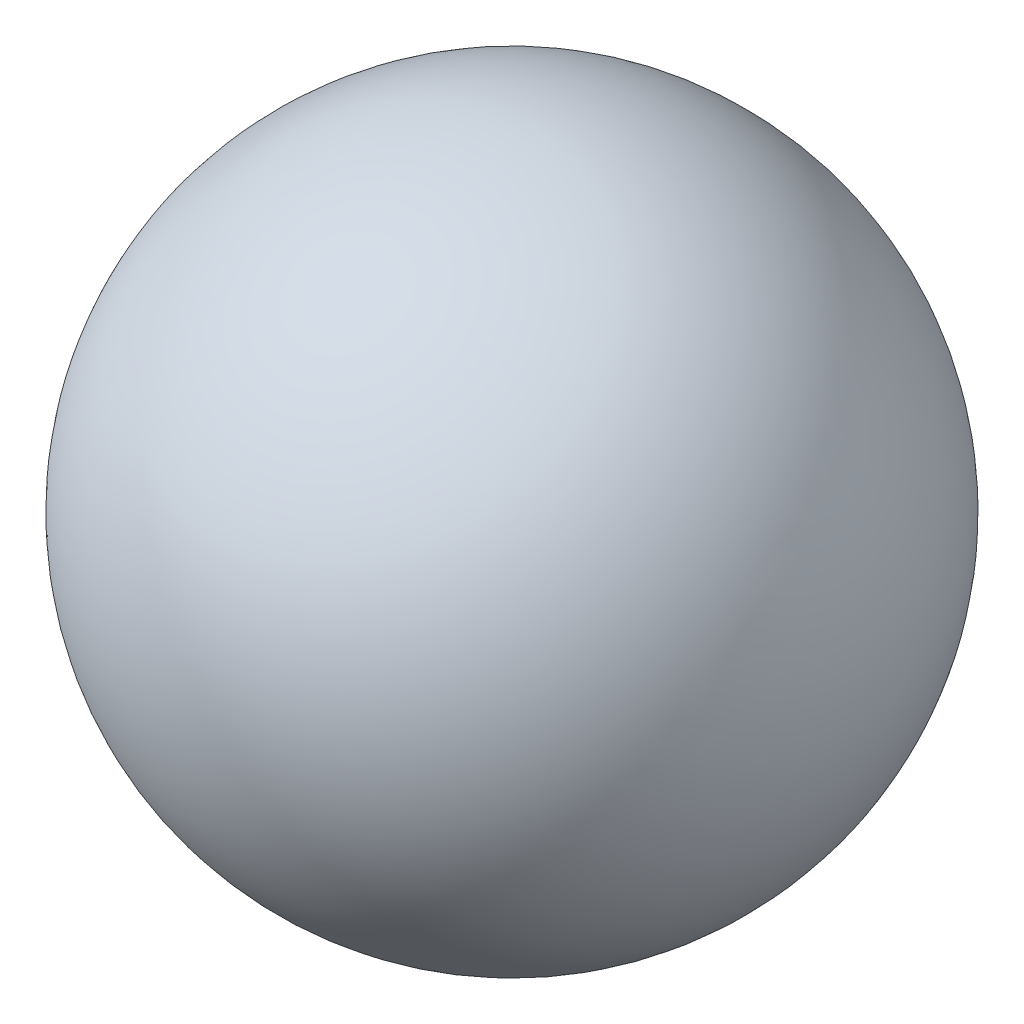
ISO-10303-21;
HEADER;
FILE_DESCRIPTION(('STEP AP214'),'2;1');
FILE_NAME('part.step','',(''),(''),'','','');
FILE_SCHEMA(('AUTOMOTIVE_DESIGN { 1 0 10303 214 1 1 1 1 }'));
ENDSEC;
DATA;
#1=APPLICATION_CONTEXT('core data for automotive mechanical design processes');
#2=APPLICATION_PROTOCOL_DEFINITION('international standard','automotive_design',2000,#1);
#3=PRODUCT_CONTEXT('',#1,'mechanical');
#4=PRODUCT('Part','Part','',(#3));
#5=PRODUCT_RELATED_PRODUCT_CATEGORY('part','',(#4));
#6=PRODUCT_DEFINITION_FORMATION('','',#4);
#7=PRODUCT_DEFINITION_CONTEXT('part definition',#1,'design');
#8=PRODUCT_DEFINITION('design','',#6,#7);
#9=PRODUCT_DEFINITION_SHAPE('','',#8);
#10=(LENGTH_UNIT() NAMED_UNIT(*) SI_UNIT(.MILLI.,.METRE.));
#11=(NAMED_UNIT(*) PLANE_ANGLE_UNIT() SI_UNIT($,.RADIAN.));
#12=(NAMED_UNIT(*) SI_UNIT($,.STERADIAN.) SOLID_ANGLE_UNIT());
#13=UNCERTAINTY_MEASURE_WITH_UNIT(LENGTH_MEASURE(1.E-05),#10,'distance_accuracy_value','');
#14=(GEOMETRIC_REPRESENTATION_CONTEXT(3) GLOBAL_UNCERTAINTY_ASSIGNED_CONTEXT((#13)) GLOBAL_UNIT_ASSIGNED_CONTEXT((#10,
#11,#12)) REPRESENTATION_CONTEXT('',''));
#15=CARTESIAN_POINT('',(0.,0.,0.));
#16=DIRECTION('',(0.,0.,1.));
#17=DIRECTION('',(1.,0.,0.));
#18=AXIS2_PLACEMENT_3D('',#15,#16,#17);
#19=CARTESIAN_POINT('',(0.,0.,0.));
#20=DIRECTION('',(-1.,0.,0.));
#21=DIRECTION('',(0.,1.,0.));
#22=AXIS2_PLACEMENT_3D('',#19,#20,#21);
#23=SPHERICAL_SURFACE('',#22,18.034);
#24=CARTESIAN_POINT('',(-18.034,0.,0.));
#25=VERTEX_POINT('',#24);
#26=VERTEX_LOOP('',#25);
#27=FACE_BOUND('',#26,.T.);
#28=ADVANCED_FACE('F356',(#27),#23,.T.);
#29=CLOSED_SHELL('',(#28));
#30=MANIFOLD_SOLID_BREP('B2',#29);
#31=ADVANCED_BREP_SHAPE_REPRESENTATION('',(#18,#30),#14);
#32=SHAPE_DEFINITION_REPRESENTATION(#9,#31);
ENDSEC;
END-ISO-10303-21;
